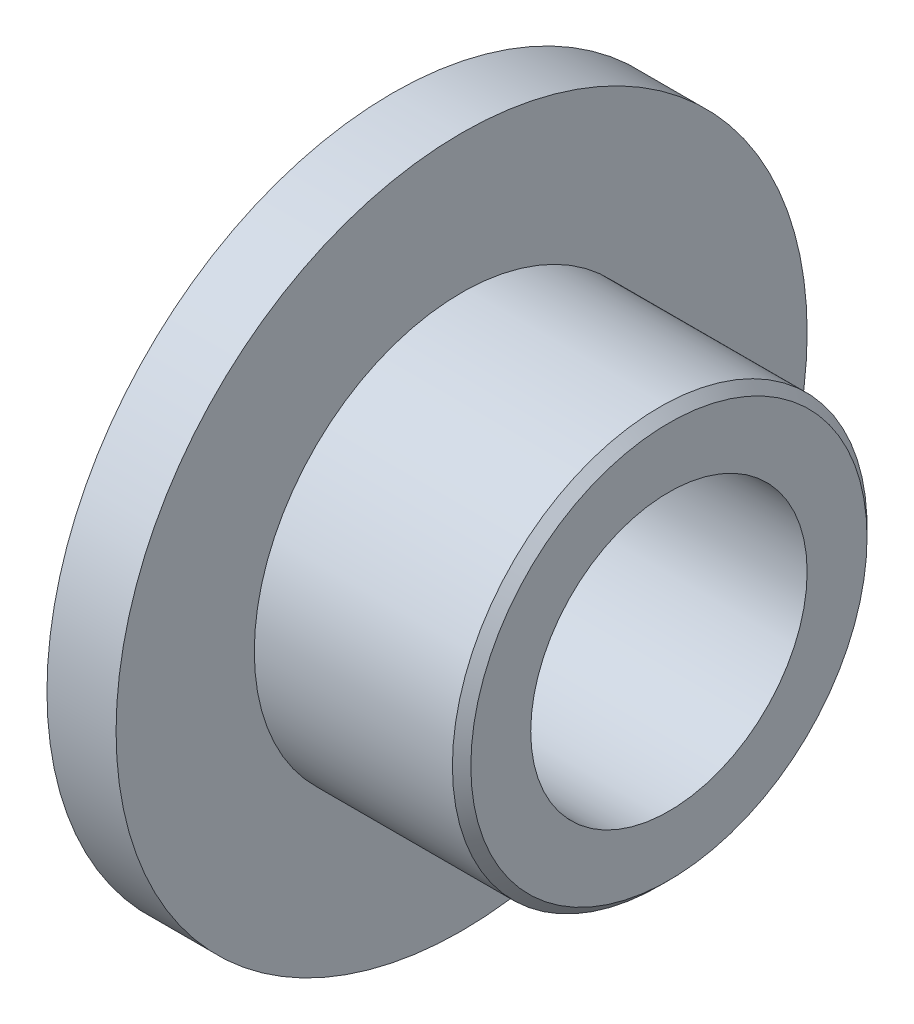
ISO-10303-21;
HEADER;
FILE_DESCRIPTION(('STEP AP214'),'2;1');
FILE_NAME('part.step','',(''),(''),'','','');
FILE_SCHEMA(('AUTOMOTIVE_DESIGN { 1 0 10303 214 1 1 1 1 }'));
ENDSEC;
DATA;
#1=APPLICATION_CONTEXT('core data for automotive mechanical design processes');
#2=APPLICATION_PROTOCOL_DEFINITION('international standard','automotive_design',2000,#1);
#3=PRODUCT_CONTEXT('',#1,'mechanical');
#4=PRODUCT('Part','Part','',(#3));
#5=PRODUCT_RELATED_PRODUCT_CATEGORY('part','',(#4));
#6=PRODUCT_DEFINITION_FORMATION('','',#4);
#7=PRODUCT_DEFINITION_CONTEXT('part definition',#1,'design');
#8=PRODUCT_DEFINITION('design','',#6,#7);
#9=PRODUCT_DEFINITION_SHAPE('','',#8);
#10=(LENGTH_UNIT() NAMED_UNIT(*) SI_UNIT(.MILLI.,.METRE.));
#11=(NAMED_UNIT(*) PLANE_ANGLE_UNIT() SI_UNIT($,.RADIAN.));
#12=(NAMED_UNIT(*) SI_UNIT($,.STERADIAN.) SOLID_ANGLE_UNIT());
#13=UNCERTAINTY_MEASURE_WITH_UNIT(LENGTH_MEASURE(1.E-05),#10,'distance_accuracy_value','');
#14=(GEOMETRIC_REPRESENTATION_CONTEXT(3) GLOBAL_UNCERTAINTY_ASSIGNED_CONTEXT((#13)) GLOBAL_UNIT_ASSIGNED_CONTEXT((#10,
#11,#12)) REPRESENTATION_CONTEXT('',''));
#15=CARTESIAN_POINT('',(0.,0.,0.));
#16=DIRECTION('',(0.,0.,1.));
#17=DIRECTION('',(1.,0.,0.));
#18=AXIS2_PLACEMENT_3D('',#15,#16,#17);
#19=CARTESIAN_POINT('',(0.,1.5,0.));
#20=DIRECTION('',(-1.,0.,0.));
#21=DIRECTION('',(0.,0.,1.));
#22=AXIS2_PLACEMENT_3D('',#19,#20,#21);
#23=PLANE('',#22);
#24=CARTESIAN_POINT('',(0.,0.,0.));
#25=DIRECTION('',(-1.,0.,0.));
#26=DIRECTION('',(0.,0.,1.));
#27=AXIS2_PLACEMENT_3D('',#24,#25,#26);
#28=CIRCLE('',#27,3.75);
#29=CARTESIAN_POINT('',(0.,0.,3.75));
#30=VERTEX_POINT('',#29);
#31=EDGE_CURVE('E10',#30,#30,#28,.T.);
#32=ORIENTED_EDGE('',*,*,#31,.T.);
#33=EDGE_LOOP('',(#32));
#34=FACE_BOUND('',#33,.T.);
#35=CARTESIAN_POINT('',(0.,0.,0.));
#36=DIRECTION('',(-1.,0.,0.));
#37=DIRECTION('',(0.,0.,1.));
#38=AXIS2_PLACEMENT_3D('',#35,#36,#37);
#39=CIRCLE('',#38,1.5);
#40=CARTESIAN_POINT('',(0.,0.,1.5));
#41=VERTEX_POINT('',#40);
#42=EDGE_CURVE('E59',#41,#41,#39,.T.);
#43=ORIENTED_EDGE('',*,*,#42,.F.);
#44=EDGE_LOOP('',(#43));
#45=FACE_BOUND('',#44,.T.);
#46=ADVANCED_FACE('F34',(#34,#45),#23,.T.);
#47=CARTESIAN_POINT('',(4.,0.,0.));
#48=DIRECTION('',(-1.,0.,0.));
#49=DIRECTION('',(0.,0.,1.));
#50=AXIS2_PLACEMENT_3D('',#47,#48,#49);
#51=CYLINDRICAL_SURFACE('',#50,3.75);
#52=CARTESIAN_POINT('',(0.75,0.,0.));
#53=DIRECTION('',(-1.,0.,0.));
#54=DIRECTION('',(0.,0.,1.));
#55=AXIS2_PLACEMENT_3D('',#52,#53,#54);
#56=CIRCLE('',#55,3.75);
#57=CARTESIAN_POINT('',(0.75,0.,3.75));
#58=VERTEX_POINT('',#57);
#59=EDGE_CURVE('E40',#58,#58,#56,.T.);
#60=ORIENTED_EDGE('',*,*,#59,.T.);
#61=EDGE_LOOP('',(#60));
#62=FACE_BOUND('',#61,.T.);
#63=ORIENTED_EDGE('',*,*,#31,.F.);
#64=EDGE_LOOP('',(#63));
#65=FACE_BOUND('',#64,.T.);
#66=ADVANCED_FACE('F67',(#62,#65),#51,.T.);
#67=CARTESIAN_POINT('',(0.75,3.75,0.));
#68=DIRECTION('',(1.,0.,0.));
#69=DIRECTION('',(0.,0.,-1.));
#70=AXIS2_PLACEMENT_3D('',#67,#68,#69);
#71=PLANE('',#70);
#72=CARTESIAN_POINT('',(0.75,0.,0.));
#73=DIRECTION('',(-1.,0.,0.));
#74=DIRECTION('',(0.,0.,1.));
#75=AXIS2_PLACEMENT_3D('',#72,#73,#74);
#76=CIRCLE('',#75,2.25);
#77=CARTESIAN_POINT('',(0.75,0.,2.25));
#78=VERTEX_POINT('',#77);
#79=EDGE_CURVE('E44',#78,#78,#76,.T.);
#80=ORIENTED_EDGE('',*,*,#79,.T.);
#81=EDGE_LOOP('',(#80));
#82=FACE_BOUND('',#81,.T.);
#83=ORIENTED_EDGE('',*,*,#59,.F.);
#84=EDGE_LOOP('',(#83));
#85=FACE_BOUND('',#84,.T.);
#86=ADVANCED_FACE('F71',(#82,#85),#71,.T.);
#87=CARTESIAN_POINT('',(4.,0.,0.));
#88=DIRECTION('',(-1.,0.,0.));
#89=DIRECTION('',(0.,0.,1.));
#90=AXIS2_PLACEMENT_3D('',#87,#88,#89);
#91=CYLINDRICAL_SURFACE('',#90,2.25);
#92=CARTESIAN_POINT('',(2.9,0.,0.));
#93=DIRECTION('',(-1.,0.,0.));
#94=DIRECTION('',(0.,0.,1.));
#95=AXIS2_PLACEMENT_3D('',#92,#93,#94);
#96=CIRCLE('',#95,2.25);
#97=CARTESIAN_POINT('',(2.9,0.,2.25));
#98=VERTEX_POINT('',#97);
#99=EDGE_CURVE('E48',#98,#98,#96,.T.);
#100=ORIENTED_EDGE('',*,*,#99,.T.);
#101=EDGE_LOOP('',(#100));
#102=FACE_BOUND('',#101,.T.);
#103=ORIENTED_EDGE('',*,*,#79,.F.);
#104=EDGE_LOOP('',(#103));
#105=FACE_BOUND('',#104,.T.);
#106=ADVANCED_FACE('F75',(#102,#105),#91,.T.);
#107=CARTESIAN_POINT('',(2.9,0.,0.));
#108=DIRECTION('',(-1.,0.,0.));
#109=DIRECTION('',(0.,0.,1.));
#110=AXIS2_PLACEMENT_3D('',#107,#108,#109);
#111=CONICAL_SURFACE('',#110,2.25,0.785398163397457);
#112=CARTESIAN_POINT('',(3.,0.,0.));
#113=DIRECTION('',(-1.,0.,0.));
#114=DIRECTION('',(0.,0.,1.));
#115=AXIS2_PLACEMENT_3D('',#112,#113,#114);
#116=CIRCLE('',#115,2.15);
#117=CARTESIAN_POINT('',(3.,0.,2.15));
#118=VERTEX_POINT('',#117);
#119=EDGE_CURVE('E53',#118,#118,#116,.T.);
#120=ORIENTED_EDGE('',*,*,#119,.T.);
#121=EDGE_LOOP('',(#120));
#122=FACE_BOUND('',#121,.T.);
#123=ORIENTED_EDGE('',*,*,#99,.F.);
#124=EDGE_LOOP('',(#123));
#125=FACE_BOUND('',#124,.T.);
#126=ADVANCED_FACE('F82',(#122,#125),#111,.T.);
#127=CARTESIAN_POINT('',(3.,2.15,0.));
#128=DIRECTION('',(1.,0.,0.));
#129=DIRECTION('',(0.,0.,-1.));
#130=AXIS2_PLACEMENT_3D('',#127,#128,#129);
#131=PLANE('',#130);
#132=CARTESIAN_POINT('',(3.,0.,0.));
#133=DIRECTION('',(-1.,0.,0.));
#134=DIRECTION('',(0.,0.,1.));
#135=AXIS2_PLACEMENT_3D('',#132,#133,#134);
#136=CIRCLE('',#135,1.5);
#137=CARTESIAN_POINT('',(3.,0.,1.5));
#138=VERTEX_POINT('',#137);
#139=EDGE_CURVE('E56',#138,#138,#136,.T.);
#140=ORIENTED_EDGE('',*,*,#139,.T.);
#141=EDGE_LOOP('',(#140));
#142=FACE_BOUND('',#141,.T.);
#143=ORIENTED_EDGE('',*,*,#119,.F.);
#144=EDGE_LOOP('',(#143));
#145=FACE_BOUND('',#144,.T.);
#146=ADVANCED_FACE('F86',(#142,#145),#131,.T.);
#147=CARTESIAN_POINT('',(4.,0.,0.));
#148=DIRECTION('',(-1.,0.,0.));
#149=DIRECTION('',(0.,0.,1.));
#150=AXIS2_PLACEMENT_3D('',#147,#148,#149);
#151=CYLINDRICAL_SURFACE('',#150,1.5);
#152=ORIENTED_EDGE('',*,*,#42,.T.);
#153=EDGE_LOOP('',(#152));
#154=FACE_BOUND('',#153,.T.);
#155=ORIENTED_EDGE('',*,*,#139,.F.);
#156=EDGE_LOOP('',(#155));
#157=FACE_BOUND('',#156,.T.);
#158=ADVANCED_FACE('F63',(#154,#157),#151,.F.);
#159=CLOSED_SHELL('',(#46,#66,#86,#106,#126,#146,#158));
#160=MANIFOLD_SOLID_BREP('B2',#159);
#161=ADVANCED_BREP_SHAPE_REPRESENTATION('',(#18,#160),#14);
#162=SHAPE_DEFINITION_REPRESENTATION(#9,#161);
ENDSEC;
END-ISO-10303-21;
